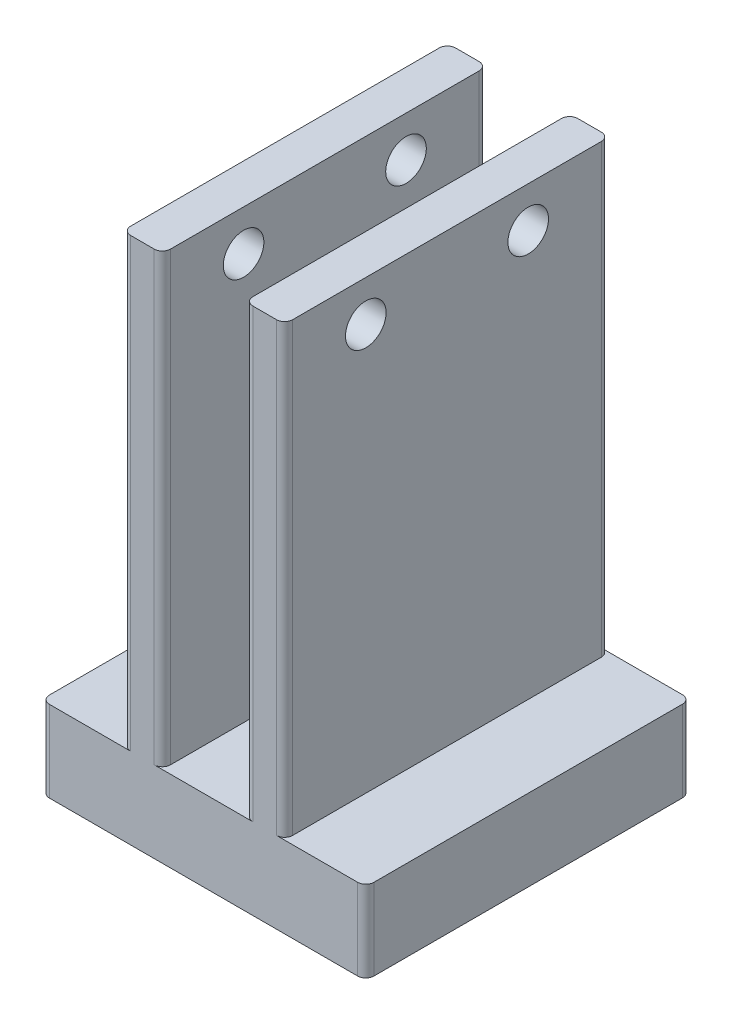
ISO-10303-21;
HEADER;
FILE_DESCRIPTION(('STEP AP214'),'2;1');
FILE_NAME('part.step','',(''),(''),'','','');
FILE_SCHEMA(('AUTOMOTIVE_DESIGN { 1 0 10303 214 1 1 1 1 }'));
ENDSEC;
DATA;
#1=APPLICATION_CONTEXT('core data for automotive mechanical design processes');
#2=APPLICATION_PROTOCOL_DEFINITION('international standard','automotive_design',2000,#1);
#3=PRODUCT_CONTEXT('',#1,'mechanical');
#4=PRODUCT('Part','Part','',(#3));
#5=PRODUCT_RELATED_PRODUCT_CATEGORY('part','',(#4));
#6=PRODUCT_DEFINITION_FORMATION('','',#4);
#7=PRODUCT_DEFINITION_CONTEXT('part definition',#1,'design');
#8=PRODUCT_DEFINITION('design','',#6,#7);
#9=PRODUCT_DEFINITION_SHAPE('','',#8);
#10=(LENGTH_UNIT() NAMED_UNIT(*) SI_UNIT(.MILLI.,.METRE.));
#11=(NAMED_UNIT(*) PLANE_ANGLE_UNIT() SI_UNIT($,.RADIAN.));
#12=(NAMED_UNIT(*) SI_UNIT($,.STERADIAN.) SOLID_ANGLE_UNIT());
#13=UNCERTAINTY_MEASURE_WITH_UNIT(LENGTH_MEASURE(1.E-05),#10,'distance_accuracy_value','');
#14=(GEOMETRIC_REPRESENTATION_CONTEXT(3) GLOBAL_UNCERTAINTY_ASSIGNED_CONTEXT((#13)) GLOBAL_UNIT_ASSIGNED_CONTEXT((#10,
#11,#12)) REPRESENTATION_CONTEXT('',''));
#15=CARTESIAN_POINT('',(0.,0.,0.));
#16=DIRECTION('',(0.,0.,1.));
#17=DIRECTION('',(1.,0.,0.));
#18=AXIS2_PLACEMENT_3D('',#15,#16,#17);
#19=CARTESIAN_POINT('',(7.44999999999999,-10.,20.));
#20=DIRECTION('',(-1.,0.,0.));
#21=DIRECTION('',(0.,0.,1.));
#22=AXIS2_PLACEMENT_3D('',#19,#20,#21);
#23=PLANE('',#22);
#24=CARTESIAN_POINT('',(7.44999999999999,50.,10.));
#25=DIRECTION('',(-1.,0.,0.));
#26=DIRECTION('',(0.,0.,1.));
#27=AXIS2_PLACEMENT_3D('',#24,#25,#26);
#28=CIRCLE('',#27,2.5);
#29=CARTESIAN_POINT('',(7.44999999999999,50.,12.5));
#30=VERTEX_POINT('',#29);
#31=EDGE_CURVE('E270',#30,#30,#28,.F.);
#32=ORIENTED_EDGE('',*,*,#31,.F.);
#33=EDGE_LOOP('',(#32));
#34=FACE_BOUND('',#33,.T.);
#35=CARTESIAN_POINT('',(7.44999999999999,50.,-10.));
#36=DIRECTION('',(-1.,0.,0.));
#37=DIRECTION('',(0.,0.,1.));
#38=AXIS2_PLACEMENT_3D('',#35,#36,#37);
#39=CIRCLE('',#38,2.5);
#40=CARTESIAN_POINT('',(7.44999999999999,50.,-7.5));
#41=VERTEX_POINT('',#40);
#42=EDGE_CURVE('E275',#41,#41,#39,.F.);
#43=ORIENTED_EDGE('',*,*,#42,.F.);
#44=EDGE_LOOP('',(#43));
#45=FACE_BOUND('',#44,.T.);
#46=DIRECTION('',(0.,0.,-1.));
#47=VECTOR('',#46,1.);
#48=CARTESIAN_POINT('',(7.45,55.,-20.));
#49=LINE('',#48,#47);
#50=CARTESIAN_POINT('',(7.45,55.,19.));
#51=VERTEX_POINT('',#50);
#52=CARTESIAN_POINT('',(7.45,55.,-19.));
#53=VERTEX_POINT('',#52);
#54=EDGE_CURVE('E306',#51,#53,#49,.T.);
#55=ORIENTED_EDGE('',*,*,#54,.F.);
#56=DIRECTION('',(0.,1.,0.));
#57=VECTOR('',#56,1.);
#58=CARTESIAN_POINT('',(7.44999999999999,-10.,19.));
#59=LINE('',#58,#57);
#60=CARTESIAN_POINT('',(7.44999999999999,0.,19.));
#61=VERTEX_POINT('',#60);
#62=EDGE_CURVE('E458',#51,#61,#59,.F.);
#63=ORIENTED_EDGE('',*,*,#62,.T.);
#64=DIRECTION('',(0.,0.,1.));
#65=VECTOR('',#64,1.);
#66=CARTESIAN_POINT('',(7.44999999999999,0.,20.));
#67=LINE('',#66,#65);
#68=CARTESIAN_POINT('',(7.44999999999999,0.,-19.));
#69=VERTEX_POINT('',#68);
#70=EDGE_CURVE('E238',#69,#61,#67,.T.);
#71=ORIENTED_EDGE('',*,*,#70,.F.);
#72=DIRECTION('',(0.,1.,0.));
#73=VECTOR('',#72,1.);
#74=CARTESIAN_POINT('',(7.45,-10.,-19.));
#75=LINE('',#74,#73);
#76=EDGE_CURVE('E455',#69,#53,#75,.T.);
#77=ORIENTED_EDGE('',*,*,#76,.T.);
#78=EDGE_LOOP('',(#55,#63,#71,#77));
#79=FACE_BOUND('',#78,.T.);
#80=ADVANCED_FACE('F43',(#34,#45,#79),#23,.F.);
#81=CARTESIAN_POINT('',(-12.5,55.,-20.));
#82=DIRECTION('',(1.,0.,0.));
#83=DIRECTION('',(0.,0.,-1.));
#84=AXIS2_PLACEMENT_3D('',#81,#82,#83);
#85=PLANE('',#84);
#86=CARTESIAN_POINT('',(-12.5,50.,10.));
#87=DIRECTION('',(-1.,0.,0.));
#88=DIRECTION('',(0.,0.,1.));
#89=AXIS2_PLACEMENT_3D('',#86,#87,#88);
#90=CIRCLE('',#89,2.5);
#91=CARTESIAN_POINT('',(-12.5,50.,12.5));
#92=VERTEX_POINT('',#91);
#93=EDGE_CURVE('E276',#92,#92,#90,.T.);
#94=ORIENTED_EDGE('',*,*,#93,.F.);
#95=EDGE_LOOP('',(#94));
#96=FACE_BOUND('',#95,.T.);
#97=CARTESIAN_POINT('',(-12.5,50.,-10.));
#98=DIRECTION('',(-1.,0.,0.));
#99=DIRECTION('',(0.,0.,1.));
#100=AXIS2_PLACEMENT_3D('',#97,#98,#99);
#101=CIRCLE('',#100,2.5);
#102=CARTESIAN_POINT('',(-12.5,50.,-7.5));
#103=VERTEX_POINT('',#102);
#104=EDGE_CURVE('E271',#103,#103,#101,.T.);
#105=ORIENTED_EDGE('',*,*,#104,.F.);
#106=EDGE_LOOP('',(#105));
#107=FACE_BOUND('',#106,.T.);
#108=DIRECTION('',(0.,0.,-1.));
#109=VECTOR('',#108,1.);
#110=CARTESIAN_POINT('',(-12.5,0.,-20.));
#111=LINE('',#110,#109);
#112=CARTESIAN_POINT('',(-12.5,0.,19.));
#113=VERTEX_POINT('',#112);
#114=CARTESIAN_POINT('',(-12.5,0.,-19.));
#115=VERTEX_POINT('',#114);
#116=EDGE_CURVE('E252',#113,#115,#111,.T.);
#117=ORIENTED_EDGE('',*,*,#116,.F.);
#118=DIRECTION('',(0.,-1.,0.));
#119=VECTOR('',#118,1.);
#120=CARTESIAN_POINT('',(-12.5,55.,19.));
#121=LINE('',#120,#119);
#122=CARTESIAN_POINT('',(-12.5,55.,19.));
#123=VERTEX_POINT('',#122);
#124=EDGE_CURVE('E465',#113,#123,#121,.F.);
#125=ORIENTED_EDGE('',*,*,#124,.T.);
#126=DIRECTION('',(0.,0.,1.));
#127=VECTOR('',#126,1.);
#128=CARTESIAN_POINT('',(-12.5,55.,-20.));
#129=LINE('',#128,#127);
#130=CARTESIAN_POINT('',(-12.5,55.,-19.));
#131=VERTEX_POINT('',#130);
#132=EDGE_CURVE('E327',#131,#123,#129,.T.);
#133=ORIENTED_EDGE('',*,*,#132,.F.);
#134=DIRECTION('',(0.,-1.,0.));
#135=VECTOR('',#134,1.);
#136=CARTESIAN_POINT('',(-12.5,55.,-19.));
#137=LINE('',#136,#135);
#138=EDGE_CURVE('E461',#131,#115,#137,.T.);
#139=ORIENTED_EDGE('',*,*,#138,.T.);
#140=EDGE_LOOP('',(#117,#125,#133,#139));
#141=FACE_BOUND('',#140,.T.);
#142=ADVANCED_FACE('F565',(#96,#107,#141),#85,.F.);
#143=CARTESIAN_POINT('',(0.,0.,0.));
#144=DIRECTION('',(0.,-1.,0.));
#145=DIRECTION('',(0.,0.,-1.));
#146=AXIS2_PLACEMENT_3D('',#143,#144,#145);
#147=PLANE('',#146);
#148=DIRECTION('',(0.,0.,1.));
#149=VECTOR('',#148,1.);
#150=CARTESIAN_POINT('',(2.55,0.,-20.));
#151=LINE('',#150,#149);
#152=CARTESIAN_POINT('',(2.55,0.,-19.));
#153=VERTEX_POINT('',#152);
#154=CARTESIAN_POINT('',(2.55,0.,19.));
#155=VERTEX_POINT('',#154);
#156=EDGE_CURVE('E297',#153,#155,#151,.T.);
#157=ORIENTED_EDGE('',*,*,#156,.F.);
#158=CARTESIAN_POINT('',(3.55,0.,-19.));
#159=DIRECTION('',(0.,-1.,0.));
#160=DIRECTION('',(0.,0.,-1.));
#161=AXIS2_PLACEMENT_3D('',#158,#159,#160);
#162=CIRCLE('',#161,1.);
#163=CARTESIAN_POINT('',(3.55,0.,-20.));
#164=VERTEX_POINT('',#163);
#165=EDGE_CURVE('E471',#153,#164,#162,.T.);
#166=ORIENTED_EDGE('',*,*,#165,.T.);
#167=DIRECTION('',(1.,0.,0.));
#168=VECTOR('',#167,1.);
#169=CARTESIAN_POINT('',(-12.5,0.,-20.));
#170=LINE('',#169,#168);
#171=CARTESIAN_POINT('',(-8.60000000000001,0.,-20.));
#172=VERTEX_POINT('',#171);
#173=EDGE_CURVE('E301',#172,#164,#170,.T.);
#174=ORIENTED_EDGE('',*,*,#173,.F.);
#175=CARTESIAN_POINT('',(-8.60000000000001,0.,-19.));
#176=DIRECTION('',(0.,-1.,0.));
#177=DIRECTION('',(0.,0.,-1.));
#178=AXIS2_PLACEMENT_3D('',#175,#176,#177);
#179=CIRCLE('',#178,1.);
#180=CARTESIAN_POINT('',(-7.60000000000001,0.,-19.));
#181=VERTEX_POINT('',#180);
#182=EDGE_CURVE('E468',#172,#181,#179,.T.);
#183=ORIENTED_EDGE('',*,*,#182,.T.);
#184=DIRECTION('',(0.,0.,-1.));
#185=VECTOR('',#184,1.);
#186=CARTESIAN_POINT('',(-7.60000000000001,0.,-20.));
#187=LINE('',#186,#185);
#188=CARTESIAN_POINT('',(-7.6,0.,19.));
#189=VERTEX_POINT('',#188);
#190=EDGE_CURVE('E322',#189,#181,#187,.T.);
#191=ORIENTED_EDGE('',*,*,#190,.F.);
#192=CARTESIAN_POINT('',(-8.6,0.,19.));
#193=DIRECTION('',(0.,-1.,0.));
#194=DIRECTION('',(0.,0.,-1.));
#195=AXIS2_PLACEMENT_3D('',#192,#193,#194);
#196=CIRCLE('',#195,1.);
#197=CARTESIAN_POINT('',(-8.6,0.,20.));
#198=VERTEX_POINT('',#197);
#199=EDGE_CURVE('E478',#189,#198,#196,.T.);
#200=ORIENTED_EDGE('',*,*,#199,.T.);
#201=DIRECTION('',(-1.,0.,0.));
#202=VECTOR('',#201,1.);
#203=CARTESIAN_POINT('',(-12.5,0.,20.));
#204=LINE('',#203,#202);
#205=CARTESIAN_POINT('',(3.55,0.,20.));
#206=VERTEX_POINT('',#205);
#207=EDGE_CURVE('E319',#206,#198,#204,.T.);
#208=ORIENTED_EDGE('',*,*,#207,.F.);
#209=CARTESIAN_POINT('',(3.55,0.,19.));
#210=DIRECTION('',(0.,-1.,0.));
#211=DIRECTION('',(0.,0.,-1.));
#212=AXIS2_PLACEMENT_3D('',#209,#210,#211);
#213=CIRCLE('',#212,1.);
#214=EDGE_CURVE('E475',#206,#155,#213,.T.);
#215=ORIENTED_EDGE('',*,*,#214,.T.);
#216=EDGE_LOOP('',(#157,#166,#174,#183,#191,#200,#208,#215));
#217=FACE_BOUND('',#216,.T.);
#218=ADVANCED_FACE('F518',(#217),#147,.F.);
#219=CARTESIAN_POINT('',(-12.5,55.,20.));
#220=DIRECTION('',(0.,0.,-1.));
#221=DIRECTION('',(-1.,0.,0.));
#222=AXIS2_PLACEMENT_3D('',#219,#220,#221);
#223=PLANE('',#222);
#224=DIRECTION('',(1.,0.,0.));
#225=VECTOR('',#224,1.);
#226=CARTESIAN_POINT('',(-22.5,0.,20.));
#227=LINE('',#226,#225);
#228=CARTESIAN_POINT('',(-21.5,0.,20.));
#229=VERTEX_POINT('',#228);
#230=CARTESIAN_POINT('',(-11.5,0.,20.));
#231=VERTEX_POINT('',#230);
#232=EDGE_CURVE('E267',#229,#231,#227,.T.);
#233=ORIENTED_EDGE('',*,*,#232,.F.);
#234=DIRECTION('',(0.,1.,0.));
#235=VECTOR('',#234,1.);
#236=CARTESIAN_POINT('',(-21.5,55.,20.));
#237=LINE('',#236,#235);
#238=CARTESIAN_POINT('',(-21.5,-10.,20.));
#239=VERTEX_POINT('',#238);
#240=EDGE_CURVE('E416',#229,#239,#237,.F.);
#241=ORIENTED_EDGE('',*,*,#240,.T.);
#242=DIRECTION('',(-1.,0.,0.));
#243=VECTOR('',#242,1.);
#244=CARTESIAN_POINT('',(-12.5,-10.,20.));
#245=LINE('',#244,#243);
#246=CARTESIAN_POINT('',(16.45,-10.,20.));
#247=VERTEX_POINT('',#246);
#248=EDGE_CURVE('E318',#247,#239,#245,.T.);
#249=ORIENTED_EDGE('',*,*,#248,.F.);
#250=DIRECTION('',(0.,-1.,0.));
#251=VECTOR('',#250,1.);
#252=CARTESIAN_POINT('',(16.45,55.,20.));
#253=LINE('',#252,#251);
#254=CARTESIAN_POINT('',(16.45,0.,20.));
#255=VERTEX_POINT('',#254);
#256=EDGE_CURVE('E211',#247,#255,#253,.F.);
#257=ORIENTED_EDGE('',*,*,#256,.T.);
#258=DIRECTION('',(-1.,0.,0.));
#259=VECTOR('',#258,1.);
#260=CARTESIAN_POINT('',(17.45,0.,20.));
#261=LINE('',#260,#259);
#262=CARTESIAN_POINT('',(6.44999999999999,0.,20.));
#263=VERTEX_POINT('',#262);
#264=EDGE_CURVE('E242',#255,#263,#261,.T.);
#265=ORIENTED_EDGE('',*,*,#264,.T.);
#266=DIRECTION('',(0.,1.,0.));
#267=VECTOR('',#266,1.);
#268=CARTESIAN_POINT('',(6.44999999999999,55.,20.));
#269=LINE('',#268,#267);
#270=CARTESIAN_POINT('',(6.44999999999999,55.,20.));
#271=VERTEX_POINT('',#270);
#272=EDGE_CURVE('E403',#263,#271,#269,.T.);
#273=ORIENTED_EDGE('',*,*,#272,.T.);
#274=DIRECTION('',(1.,0.,0.));
#275=VECTOR('',#274,1.);
#276=CARTESIAN_POINT('',(2.55,55.,20.));
#277=LINE('',#276,#275);
#278=CARTESIAN_POINT('',(3.55,55.,20.));
#279=VERTEX_POINT('',#278);
#280=EDGE_CURVE('E309',#279,#271,#277,.T.);
#281=ORIENTED_EDGE('',*,*,#280,.F.);
#282=DIRECTION('',(0.,-1.,0.));
#283=VECTOR('',#282,1.);
#284=CARTESIAN_POINT('',(3.55,55.,20.));
#285=LINE('',#284,#283);
#286=EDGE_CURVE('E410',#279,#206,#285,.T.);
#287=ORIENTED_EDGE('',*,*,#286,.T.);
#288=ORIENTED_EDGE('',*,*,#207,.T.);
#289=DIRECTION('',(0.,-1.,0.));
#290=VECTOR('',#289,1.);
#291=CARTESIAN_POINT('',(-8.6,55.,20.));
#292=LINE('',#291,#290);
#293=CARTESIAN_POINT('',(-8.6,55.,20.));
#294=VERTEX_POINT('',#293);
#295=EDGE_CURVE('E407',#198,#294,#292,.F.);
#296=ORIENTED_EDGE('',*,*,#295,.T.);
#297=DIRECTION('',(1.,0.,0.));
#298=VECTOR('',#297,1.);
#299=CARTESIAN_POINT('',(-12.5,55.,20.));
#300=LINE('',#299,#298);
#301=CARTESIAN_POINT('',(-11.5,55.,20.));
#302=VERTEX_POINT('',#301);
#303=EDGE_CURVE('E331',#302,#294,#300,.T.);
#304=ORIENTED_EDGE('',*,*,#303,.F.);
#305=DIRECTION('',(0.,-1.,0.));
#306=VECTOR('',#305,1.);
#307=CARTESIAN_POINT('',(-11.5,55.,20.));
#308=LINE('',#307,#306);
#309=EDGE_CURVE('E399',#302,#231,#308,.T.);
#310=ORIENTED_EDGE('',*,*,#309,.T.);
#311=EDGE_LOOP('',(#233,#241,#249,#257,#265,#273,#281,#287,#288,#296,#304,#310));
#312=FACE_BOUND('',#311,.T.);
#313=ADVANCED_FACE('F536',(#312),#223,.F.);
#314=CARTESIAN_POINT('',(-7.60000000000001,55.,-20.));
#315=DIRECTION('',(-1.,0.,0.));
#316=DIRECTION('',(0.,0.,1.));
#317=AXIS2_PLACEMENT_3D('',#314,#315,#316);
#318=PLANE('',#317);
#319=CARTESIAN_POINT('',(-7.60000000000001,50.,-10.));
#320=DIRECTION('',(-1.,0.,0.));
#321=DIRECTION('',(0.,0.,1.));
#322=AXIS2_PLACEMENT_3D('',#319,#320,#321);
#323=CIRCLE('',#322,2.5);
#324=CARTESIAN_POINT('',(-7.6,50.,-7.5));
#325=VERTEX_POINT('',#324);
#326=EDGE_CURVE('E292',#325,#325,#323,.T.);
#327=ORIENTED_EDGE('',*,*,#326,.T.);
#328=EDGE_LOOP('',(#327));
#329=FACE_BOUND('',#328,.T.);
#330=CARTESIAN_POINT('',(-7.6,50.,10.));
#331=DIRECTION('',(-1.,0.,0.));
#332=DIRECTION('',(0.,0.,1.));
#333=AXIS2_PLACEMENT_3D('',#330,#331,#332);
#334=CIRCLE('',#333,2.5);
#335=CARTESIAN_POINT('',(-7.6,50.,12.5));
#336=VERTEX_POINT('',#335);
#337=EDGE_CURVE('E287',#336,#336,#334,.T.);
#338=ORIENTED_EDGE('',*,*,#337,.T.);
#339=EDGE_LOOP('',(#338));
#340=FACE_BOUND('',#339,.T.);
#341=ORIENTED_EDGE('',*,*,#190,.T.);
#342=DIRECTION('',(0.,-1.,0.));
#343=VECTOR('',#342,1.);
#344=CARTESIAN_POINT('',(-7.60000000000001,55.,-19.));
#345=LINE('',#344,#343);
#346=CARTESIAN_POINT('',(-7.60000000000001,55.,-19.));
#347=VERTEX_POINT('',#346);
#348=EDGE_CURVE('E423',#181,#347,#345,.F.);
#349=ORIENTED_EDGE('',*,*,#348,.T.);
#350=DIRECTION('',(0.,0.,-1.));
#351=VECTOR('',#350,1.);
#352=CARTESIAN_POINT('',(-7.60000000000001,55.,-20.));
#353=LINE('',#352,#351);
#354=CARTESIAN_POINT('',(-7.6,55.,19.));
#355=VERTEX_POINT('',#354);
#356=EDGE_CURVE('E335',#355,#347,#353,.T.);
#357=ORIENTED_EDGE('',*,*,#356,.F.);
#358=DIRECTION('',(0.,-1.,0.));
#359=VECTOR('',#358,1.);
#360=CARTESIAN_POINT('',(-7.6,55.,19.));
#361=LINE('',#360,#359);
#362=EDGE_CURVE('E419',#355,#189,#361,.T.);
#363=ORIENTED_EDGE('',*,*,#362,.T.);
#364=EDGE_LOOP('',(#341,#349,#357,#363));
#365=FACE_BOUND('',#364,.T.);
#366=ADVANCED_FACE('F581',(#329,#340,#365),#318,.F.);
#367=CARTESIAN_POINT('',(-12.5,55.,-20.));
#368=DIRECTION('',(0.,0.,1.));
#369=DIRECTION('',(1.,0.,0.));
#370=AXIS2_PLACEMENT_3D('',#367,#368,#369);
#371=PLANE('',#370);
#372=DIRECTION('',(-1.,0.,0.));
#373=VECTOR('',#372,1.);
#374=CARTESIAN_POINT('',(17.45,0.,-20.));
#375=LINE('',#374,#373);
#376=CARTESIAN_POINT('',(16.45,0.,-20.));
#377=VERTEX_POINT('',#376);
#378=CARTESIAN_POINT('',(6.45,0.,-20.));
#379=VERTEX_POINT('',#378);
#380=EDGE_CURVE('E249',#377,#379,#375,.T.);
#381=ORIENTED_EDGE('',*,*,#380,.F.);
#382=DIRECTION('',(0.,1.,0.));
#383=VECTOR('',#382,1.);
#384=CARTESIAN_POINT('',(16.45,55.,-20.));
#385=LINE('',#384,#383);
#386=CARTESIAN_POINT('',(16.45,-10.,-20.));
#387=VERTEX_POINT('',#386);
#388=EDGE_CURVE('E218',#377,#387,#385,.F.);
#389=ORIENTED_EDGE('',*,*,#388,.T.);
#390=DIRECTION('',(1.,0.,0.));
#391=VECTOR('',#390,1.);
#392=CARTESIAN_POINT('',(-12.5,-10.,-20.));
#393=LINE('',#392,#391);
#394=CARTESIAN_POINT('',(-21.5,-10.,-20.));
#395=VERTEX_POINT('',#394);
#396=EDGE_CURVE('E315',#395,#387,#393,.T.);
#397=ORIENTED_EDGE('',*,*,#396,.F.);
#398=DIRECTION('',(0.,-1.,0.));
#399=VECTOR('',#398,1.);
#400=CARTESIAN_POINT('',(-21.5,55.,-20.));
#401=LINE('',#400,#399);
#402=CARTESIAN_POINT('',(-21.5,0.,-20.));
#403=VERTEX_POINT('',#402);
#404=EDGE_CURVE('E373',#395,#403,#401,.F.);
#405=ORIENTED_EDGE('',*,*,#404,.T.);
#406=DIRECTION('',(1.,0.,0.));
#407=VECTOR('',#406,1.);
#408=CARTESIAN_POINT('',(-22.5,0.,-20.));
#409=LINE('',#408,#407);
#410=CARTESIAN_POINT('',(-11.5,0.,-20.));
#411=VERTEX_POINT('',#410);
#412=EDGE_CURVE('E261',#403,#411,#409,.T.);
#413=ORIENTED_EDGE('',*,*,#412,.T.);
#414=DIRECTION('',(0.,-1.,0.));
#415=VECTOR('',#414,1.);
#416=CARTESIAN_POINT('',(-11.5,55.,-20.));
#417=LINE('',#416,#415);
#418=CARTESIAN_POINT('',(-11.5,55.,-20.));
#419=VERTEX_POINT('',#418);
#420=EDGE_CURVE('E363',#411,#419,#417,.F.);
#421=ORIENTED_EDGE('',*,*,#420,.T.);
#422=DIRECTION('',(-1.,0.,0.));
#423=VECTOR('',#422,1.);
#424=CARTESIAN_POINT('',(-12.5,55.,-20.));
#425=LINE('',#424,#423);
#426=CARTESIAN_POINT('',(-8.60000000000001,55.,-20.));
#427=VERTEX_POINT('',#426);
#428=EDGE_CURVE('E231',#427,#419,#425,.T.);
#429=ORIENTED_EDGE('',*,*,#428,.F.);
#430=DIRECTION('',(0.,-1.,0.));
#431=VECTOR('',#430,1.);
#432=CARTESIAN_POINT('',(-8.60000000000001,55.,-20.));
#433=LINE('',#432,#431);
#434=EDGE_CURVE('E369',#427,#172,#433,.T.);
#435=ORIENTED_EDGE('',*,*,#434,.T.);
#436=ORIENTED_EDGE('',*,*,#173,.T.);
#437=DIRECTION('',(0.,-1.,0.));
#438=VECTOR('',#437,1.);
#439=CARTESIAN_POINT('',(3.55,55.,-20.));
#440=LINE('',#439,#438);
#441=CARTESIAN_POINT('',(3.55,55.,-20.));
#442=VERTEX_POINT('',#441);
#443=EDGE_CURVE('E366',#164,#442,#440,.F.);
#444=ORIENTED_EDGE('',*,*,#443,.T.);
#445=DIRECTION('',(-1.,0.,0.));
#446=VECTOR('',#445,1.);
#447=CARTESIAN_POINT('',(2.55,55.,-20.));
#448=LINE('',#447,#446);
#449=CARTESIAN_POINT('',(6.45,55.,-20.));
#450=VERTEX_POINT('',#449);
#451=EDGE_CURVE('E296',#450,#442,#448,.T.);
#452=ORIENTED_EDGE('',*,*,#451,.F.);
#453=DIRECTION('',(0.,1.,0.));
#454=VECTOR('',#453,1.);
#455=CARTESIAN_POINT('',(6.45,55.,-20.));
#456=LINE('',#455,#454);
#457=EDGE_CURVE('E359',#450,#379,#456,.F.);
#458=ORIENTED_EDGE('',*,*,#457,.T.);
#459=EDGE_LOOP('',(#381,#389,#397,#405,#413,#421,#429,#435,#436,#444,#452,#458));
#460=FACE_BOUND('',#459,.T.);
#461=ADVANCED_FACE('F503',(#460),#371,.F.);
#462=CARTESIAN_POINT('',(0.,55.,0.));
#463=DIRECTION('',(0.,1.,0.));
#464=DIRECTION('',(0.,0.,1.));
#465=AXIS2_PLACEMENT_3D('',#462,#463,#464);
#466=PLANE('',#465);
#467=ORIENTED_EDGE('',*,*,#356,.T.);
#468=CARTESIAN_POINT('',(-8.60000000000001,55.,-19.));
#469=DIRECTION('',(0.,1.,0.));
#470=DIRECTION('',(0.,0.,1.));
#471=AXIS2_PLACEMENT_3D('',#468,#469,#470);
#472=CIRCLE('',#471,1.);
#473=EDGE_CURVE('E435',#347,#427,#472,.T.);
#474=ORIENTED_EDGE('',*,*,#473,.T.);
#475=ORIENTED_EDGE('',*,*,#428,.T.);
#476=CARTESIAN_POINT('',(-11.5,55.,-19.));
#477=DIRECTION('',(0.,1.,0.));
#478=DIRECTION('',(0.,0.,1.));
#479=AXIS2_PLACEMENT_3D('',#476,#477,#478);
#480=CIRCLE('',#479,1.);
#481=EDGE_CURVE('E426',#419,#131,#480,.T.);
#482=ORIENTED_EDGE('',*,*,#481,.T.);
#483=ORIENTED_EDGE('',*,*,#132,.T.);
#484=CARTESIAN_POINT('',(-11.5,55.,19.));
#485=DIRECTION('',(0.,1.,0.));
#486=DIRECTION('',(0.,0.,1.));
#487=AXIS2_PLACEMENT_3D('',#484,#485,#486);
#488=CIRCLE('',#487,1.);
#489=EDGE_CURVE('E429',#123,#302,#488,.T.);
#490=ORIENTED_EDGE('',*,*,#489,.T.);
#491=ORIENTED_EDGE('',*,*,#303,.T.);
#492=CARTESIAN_POINT('',(-8.6,55.,19.));
#493=DIRECTION('',(0.,1.,0.));
#494=DIRECTION('',(0.,0.,1.));
#495=AXIS2_PLACEMENT_3D('',#492,#493,#494);
#496=CIRCLE('',#495,1.);
#497=EDGE_CURVE('E432',#294,#355,#496,.T.);
#498=ORIENTED_EDGE('',*,*,#497,.T.);
#499=EDGE_LOOP('',(#467,#474,#475,#482,#483,#490,#491,#498));
#500=FACE_BOUND('',#499,.T.);
#501=ADVANCED_FACE('F506',(#500),#466,.T.);
#502=CARTESIAN_POINT('',(0.,-10.,0.));
#503=DIRECTION('',(0.,-1.,0.));
#504=DIRECTION('',(0.,0.,-1.));
#505=AXIS2_PLACEMENT_3D('',#502,#503,#504);
#506=PLANE('',#505);
#507=ORIENTED_EDGE('',*,*,#396,.T.);
#508=CARTESIAN_POINT('',(16.45,-10.,-19.));
#509=DIRECTION('',(0.,-1.,0.));
#510=DIRECTION('',(0.,0.,-1.));
#511=AXIS2_PLACEMENT_3D('',#508,#509,#510);
#512=CIRCLE('',#511,1.);
#513=CARTESIAN_POINT('',(17.45,-10.,-19.));
#514=VERTEX_POINT('',#513);
#515=EDGE_CURVE('E236',#387,#514,#512,.T.);
#516=ORIENTED_EDGE('',*,*,#515,.T.);
#517=DIRECTION('',(0.,0.,-1.));
#518=VECTOR('',#517,1.);
#519=CARTESIAN_POINT('',(17.45,-10.,20.));
#520=LINE('',#519,#518);
#521=CARTESIAN_POINT('',(17.45,-10.,19.));
#522=VERTEX_POINT('',#521);
#523=EDGE_CURVE('E225',#522,#514,#520,.T.);
#524=ORIENTED_EDGE('',*,*,#523,.F.);
#525=CARTESIAN_POINT('',(16.45,-10.,19.));
#526=DIRECTION('',(0.,-1.,0.));
#527=DIRECTION('',(0.,0.,-1.));
#528=AXIS2_PLACEMENT_3D('',#525,#526,#527);
#529=CIRCLE('',#528,1.);
#530=EDGE_CURVE('E206',#522,#247,#529,.T.);
#531=ORIENTED_EDGE('',*,*,#530,.T.);
#532=ORIENTED_EDGE('',*,*,#248,.T.);
#533=CARTESIAN_POINT('',(-21.5,-10.,19.));
#534=DIRECTION('',(0.,-1.,0.));
#535=DIRECTION('',(0.,0.,-1.));
#536=AXIS2_PLACEMENT_3D('',#533,#534,#535);
#537=CIRCLE('',#536,1.);
#538=CARTESIAN_POINT('',(-22.5,-10.,19.));
#539=VERTEX_POINT('',#538);
#540=EDGE_CURVE('E217',#239,#539,#537,.T.);
#541=ORIENTED_EDGE('',*,*,#540,.T.);
#542=DIRECTION('',(0.,0.,1.));
#543=VECTOR('',#542,1.);
#544=CARTESIAN_POINT('',(-22.5,-10.,-20.));
#545=LINE('',#544,#543);
#546=CARTESIAN_POINT('',(-22.5,-10.,-19.));
#547=VERTEX_POINT('',#546);
#548=EDGE_CURVE('E253',#547,#539,#545,.T.);
#549=ORIENTED_EDGE('',*,*,#548,.F.);
#550=CARTESIAN_POINT('',(-21.5,-10.,-19.));
#551=DIRECTION('',(0.,-1.,0.));
#552=DIRECTION('',(0.,0.,-1.));
#553=AXIS2_PLACEMENT_3D('',#550,#551,#552);
#554=CIRCLE('',#553,1.);
#555=EDGE_CURVE('E380',#547,#395,#554,.T.);
#556=ORIENTED_EDGE('',*,*,#555,.T.);
#557=EDGE_LOOP('',(#507,#516,#524,#531,#532,#541,#549,#556));
#558=FACE_BOUND('',#557,.T.);
#559=ADVANCED_FACE('F234',(#558),#506,.T.);
#560=CARTESIAN_POINT('',(2.55,55.,-20.));
#561=DIRECTION('',(1.,0.,0.));
#562=DIRECTION('',(0.,0.,-1.));
#563=AXIS2_PLACEMENT_3D('',#560,#561,#562);
#564=PLANE('',#563);
#565=CARTESIAN_POINT('',(2.55,50.,-10.));
#566=DIRECTION('',(1.,0.,0.));
#567=DIRECTION('',(0.,0.,-1.));
#568=AXIS2_PLACEMENT_3D('',#565,#566,#567);
#569=CIRCLE('',#568,2.5);
#570=CARTESIAN_POINT('',(2.55,50.,-12.5));
#571=VERTEX_POINT('',#570);
#572=EDGE_CURVE('E291',#571,#571,#569,.T.);
#573=ORIENTED_EDGE('',*,*,#572,.T.);
#574=EDGE_LOOP('',(#573));
#575=FACE_BOUND('',#574,.T.);
#576=CARTESIAN_POINT('',(2.55,50.,10.));
#577=DIRECTION('',(1.,0.,0.));
#578=DIRECTION('',(0.,0.,-1.));
#579=AXIS2_PLACEMENT_3D('',#576,#577,#578);
#580=CIRCLE('',#579,2.5);
#581=CARTESIAN_POINT('',(2.55,50.,7.5));
#582=VERTEX_POINT('',#581);
#583=EDGE_CURVE('E280',#582,#582,#580,.T.);
#584=ORIENTED_EDGE('',*,*,#583,.T.);
#585=EDGE_LOOP('',(#584));
#586=FACE_BOUND('',#585,.T.);
#587=DIRECTION('',(0.,0.,1.));
#588=VECTOR('',#587,1.);
#589=CARTESIAN_POINT('',(2.55,55.,-20.));
#590=LINE('',#589,#588);
#591=CARTESIAN_POINT('',(2.55,55.,-19.));
#592=VERTEX_POINT('',#591);
#593=CARTESIAN_POINT('',(2.55,55.,19.));
#594=VERTEX_POINT('',#593);
#595=EDGE_CURVE('E302',#592,#594,#590,.T.);
#596=ORIENTED_EDGE('',*,*,#595,.F.);
#597=DIRECTION('',(0.,-1.,0.));
#598=VECTOR('',#597,1.);
#599=CARTESIAN_POINT('',(2.55,55.,-19.));
#600=LINE('',#599,#598);
#601=EDGE_CURVE('E441',#592,#153,#600,.T.);
#602=ORIENTED_EDGE('',*,*,#601,.T.);
#603=ORIENTED_EDGE('',*,*,#156,.T.);
#604=DIRECTION('',(0.,-1.,0.));
#605=VECTOR('',#604,1.);
#606=CARTESIAN_POINT('',(2.55,55.,19.));
#607=LINE('',#606,#605);
#608=EDGE_CURVE('E438',#155,#594,#607,.F.);
#609=ORIENTED_EDGE('',*,*,#608,.T.);
#610=EDGE_LOOP('',(#596,#602,#603,#609));
#611=FACE_BOUND('',#610,.T.);
#612=ADVANCED_FACE('F527',(#575,#586,#611),#564,.F.);
#613=CARTESIAN_POINT('',(0.,55.,0.));
#614=DIRECTION('',(0.,1.,0.));
#615=DIRECTION('',(0.,0.,1.));
#616=AXIS2_PLACEMENT_3D('',#613,#614,#615);
#617=PLANE('',#616);
#618=ORIENTED_EDGE('',*,*,#451,.T.);
#619=CARTESIAN_POINT('',(3.55,55.,-19.));
#620=DIRECTION('',(0.,1.,0.));
#621=DIRECTION('',(0.,0.,1.));
#622=AXIS2_PLACEMENT_3D('',#619,#620,#621);
#623=CIRCLE('',#622,1.);
#624=EDGE_CURVE('E452',#442,#592,#623,.T.);
#625=ORIENTED_EDGE('',*,*,#624,.T.);
#626=ORIENTED_EDGE('',*,*,#595,.T.);
#627=CARTESIAN_POINT('',(3.55,55.,19.));
#628=DIRECTION('',(0.,1.,0.));
#629=DIRECTION('',(0.,0.,1.));
#630=AXIS2_PLACEMENT_3D('',#627,#628,#629);
#631=CIRCLE('',#630,1.);
#632=EDGE_CURVE('E449',#594,#279,#631,.T.);
#633=ORIENTED_EDGE('',*,*,#632,.T.);
#634=ORIENTED_EDGE('',*,*,#280,.T.);
#635=CARTESIAN_POINT('',(6.44999999999999,55.,19.));
#636=DIRECTION('',(0.,1.,0.));
#637=DIRECTION('',(0.,0.,1.));
#638=AXIS2_PLACEMENT_3D('',#635,#636,#637);
#639=CIRCLE('',#638,1.);
#640=EDGE_CURVE('E67',#271,#51,#639,.T.);
#641=ORIENTED_EDGE('',*,*,#640,.T.);
#642=ORIENTED_EDGE('',*,*,#54,.T.);
#643=CARTESIAN_POINT('',(6.45,55.,-19.));
#644=DIRECTION('',(0.,1.,0.));
#645=DIRECTION('',(0.,0.,1.));
#646=AXIS2_PLACEMENT_3D('',#643,#644,#645);
#647=CIRCLE('',#646,1.);
#648=EDGE_CURVE('E59',#53,#450,#647,.T.);
#649=ORIENTED_EDGE('',*,*,#648,.T.);
#650=EDGE_LOOP('',(#618,#625,#626,#633,#634,#641,#642,#649));
#651=FACE_BOUND('',#650,.T.);
#652=ADVANCED_FACE('F524',(#651),#617,.T.);
#653=CARTESIAN_POINT('',(14.5210678118655,50.,10.));
#654=DIRECTION('',(-1.,0.,0.));
#655=DIRECTION('',(0.,0.,1.));
#656=AXIS2_PLACEMENT_3D('',#653,#654,#655);
#657=CYLINDRICAL_SURFACE('',#656,2.5);
#658=ORIENTED_EDGE('',*,*,#31,.T.);
#659=EDGE_LOOP('',(#658));
#660=FACE_BOUND('',#659,.T.);
#661=ORIENTED_EDGE('',*,*,#583,.F.);
#662=EDGE_LOOP('',(#661));
#663=FACE_BOUND('',#662,.T.);
#664=ADVANCED_FACE('F628',(#660,#663),#657,.F.);
#665=CARTESIAN_POINT('',(14.5210678118655,50.,-10.));
#666=DIRECTION('',(-1.,0.,0.));
#667=DIRECTION('',(0.,0.,1.));
#668=AXIS2_PLACEMENT_3D('',#665,#666,#667);
#669=CYLINDRICAL_SURFACE('',#668,2.5);
#670=ORIENTED_EDGE('',*,*,#42,.T.);
#671=EDGE_LOOP('',(#670));
#672=FACE_BOUND('',#671,.T.);
#673=ORIENTED_EDGE('',*,*,#572,.F.);
#674=EDGE_LOOP('',(#673));
#675=FACE_BOUND('',#674,.T.);
#676=ADVANCED_FACE('F616',(#672,#675),#669,.F.);
#677=ORIENTED_EDGE('',*,*,#93,.T.);
#678=EDGE_LOOP('',(#677));
#679=FACE_BOUND('',#678,.T.);
#680=ORIENTED_EDGE('',*,*,#337,.F.);
#681=EDGE_LOOP('',(#680));
#682=FACE_BOUND('',#681,.T.);
#683=ADVANCED_FACE('F613',(#679,#682),#657,.F.);
#684=ORIENTED_EDGE('',*,*,#104,.T.);
#685=EDGE_LOOP('',(#684));
#686=FACE_BOUND('',#685,.T.);
#687=ORIENTED_EDGE('',*,*,#326,.F.);
#688=EDGE_LOOP('',(#687));
#689=FACE_BOUND('',#688,.T.);
#690=ADVANCED_FACE('F608',(#686,#689),#669,.F.);
#691=CARTESIAN_POINT('',(-22.5,0.,-20.));
#692=DIRECTION('',(0.,-1.,0.));
#693=DIRECTION('',(0.,0.,-1.));
#694=AXIS2_PLACEMENT_3D('',#691,#692,#693);
#695=PLANE('',#694);
#696=ORIENTED_EDGE('',*,*,#412,.F.);
#697=CARTESIAN_POINT('',(-21.5,0.,-19.));
#698=DIRECTION('',(0.,-1.,0.));
#699=DIRECTION('',(0.,0.,-1.));
#700=AXIS2_PLACEMENT_3D('',#697,#698,#699);
#701=CIRCLE('',#700,1.);
#702=CARTESIAN_POINT('',(-22.5,0.,-19.));
#703=VERTEX_POINT('',#702);
#704=EDGE_CURVE('E396',#403,#703,#701,.F.);
#705=ORIENTED_EDGE('',*,*,#704,.T.);
#706=DIRECTION('',(0.,0.,-1.));
#707=VECTOR('',#706,1.);
#708=CARTESIAN_POINT('',(-22.5,0.,-20.));
#709=LINE('',#708,#707);
#710=CARTESIAN_POINT('',(-22.5,0.,19.));
#711=VERTEX_POINT('',#710);
#712=EDGE_CURVE('E257',#711,#703,#709,.T.);
#713=ORIENTED_EDGE('',*,*,#712,.F.);
#714=CARTESIAN_POINT('',(-21.5,0.,19.));
#715=DIRECTION('',(0.,-1.,0.));
#716=DIRECTION('',(0.,0.,-1.));
#717=AXIS2_PLACEMENT_3D('',#714,#715,#716);
#718=CIRCLE('',#717,1.);
#719=EDGE_CURVE('E393',#711,#229,#718,.F.);
#720=ORIENTED_EDGE('',*,*,#719,.T.);
#721=ORIENTED_EDGE('',*,*,#232,.T.);
#722=CARTESIAN_POINT('',(-11.5,0.,19.));
#723=DIRECTION('',(0.,-1.,0.));
#724=DIRECTION('',(0.,0.,-1.));
#725=AXIS2_PLACEMENT_3D('',#722,#723,#724);
#726=CIRCLE('',#725,1.);
#727=EDGE_CURVE('E486',#231,#113,#726,.T.);
#728=ORIENTED_EDGE('',*,*,#727,.T.);
#729=ORIENTED_EDGE('',*,*,#116,.T.);
#730=CARTESIAN_POINT('',(-11.5,0.,-19.));
#731=DIRECTION('',(0.,-1.,0.));
#732=DIRECTION('',(0.,0.,-1.));
#733=AXIS2_PLACEMENT_3D('',#730,#731,#732);
#734=CIRCLE('',#733,1.);
#735=EDGE_CURVE('E52',#115,#411,#734,.T.);
#736=ORIENTED_EDGE('',*,*,#735,.T.);
#737=EDGE_LOOP('',(#696,#705,#713,#720,#721,#728,#729,#736));
#738=FACE_BOUND('',#737,.T.);
#739=ADVANCED_FACE('F493',(#738),#695,.F.);
#740=CARTESIAN_POINT('',(-22.5,0.,0.));
#741=DIRECTION('',(1.,0.,0.));
#742=DIRECTION('',(0.,0.,-1.));
#743=AXIS2_PLACEMENT_3D('',#740,#741,#742);
#744=PLANE('',#743);
#745=ORIENTED_EDGE('',*,*,#712,.T.);
#746=DIRECTION('',(0.,-1.,0.));
#747=VECTOR('',#746,1.);
#748=CARTESIAN_POINT('',(-22.5,0.,-19.));
#749=LINE('',#748,#747);
#750=EDGE_CURVE('E389',#703,#547,#749,.T.);
#751=ORIENTED_EDGE('',*,*,#750,.T.);
#752=ORIENTED_EDGE('',*,*,#548,.T.);
#753=DIRECTION('',(0.,1.,0.));
#754=VECTOR('',#753,1.);
#755=CARTESIAN_POINT('',(-22.5,0.,19.));
#756=LINE('',#755,#754);
#757=EDGE_CURVE('E385',#539,#711,#756,.T.);
#758=ORIENTED_EDGE('',*,*,#757,.T.);
#759=EDGE_LOOP('',(#745,#751,#752,#758));
#760=FACE_BOUND('',#759,.T.);
#761=ADVANCED_FACE('F716',(#760),#744,.F.);
#762=CARTESIAN_POINT('',(17.45,0.,20.));
#763=DIRECTION('',(0.,-1.,0.));
#764=DIRECTION('',(0.,0.,-1.));
#765=AXIS2_PLACEMENT_3D('',#762,#763,#764);
#766=PLANE('',#765);
#767=DIRECTION('',(0.,0.,1.));
#768=VECTOR('',#767,1.);
#769=CARTESIAN_POINT('',(17.45,0.,20.));
#770=LINE('',#769,#768);
#771=CARTESIAN_POINT('',(17.45,0.,-19.));
#772=VERTEX_POINT('',#771);
#773=CARTESIAN_POINT('',(17.45,0.,19.));
#774=VERTEX_POINT('',#773);
#775=EDGE_CURVE('E228',#772,#774,#770,.T.);
#776=ORIENTED_EDGE('',*,*,#775,.F.);
#777=CARTESIAN_POINT('',(16.45,0.,-19.));
#778=DIRECTION('',(0.,-1.,0.));
#779=DIRECTION('',(0.,0.,-1.));
#780=AXIS2_PLACEMENT_3D('',#777,#778,#779);
#781=CIRCLE('',#780,1.);
#782=EDGE_CURVE('E356',#772,#377,#781,.F.);
#783=ORIENTED_EDGE('',*,*,#782,.T.);
#784=ORIENTED_EDGE('',*,*,#380,.T.);
#785=CARTESIAN_POINT('',(6.45,0.,-19.));
#786=DIRECTION('',(0.,-1.,0.));
#787=DIRECTION('',(0.,0.,-1.));
#788=AXIS2_PLACEMENT_3D('',#785,#786,#787);
#789=CIRCLE('',#788,1.);
#790=EDGE_CURVE('E11',#379,#69,#789,.T.);
#791=ORIENTED_EDGE('',*,*,#790,.T.);
#792=ORIENTED_EDGE('',*,*,#70,.T.);
#793=CARTESIAN_POINT('',(6.44999999999999,0.,19.));
#794=DIRECTION('',(0.,-1.,0.));
#795=DIRECTION('',(0.,0.,-1.));
#796=AXIS2_PLACEMENT_3D('',#793,#794,#795);
#797=CIRCLE('',#796,1.);
#798=EDGE_CURVE('E482',#61,#263,#797,.T.);
#799=ORIENTED_EDGE('',*,*,#798,.T.);
#800=ORIENTED_EDGE('',*,*,#264,.F.);
#801=CARTESIAN_POINT('',(16.45,0.,19.));
#802=DIRECTION('',(0.,-1.,0.));
#803=DIRECTION('',(0.,0.,-1.));
#804=AXIS2_PLACEMENT_3D('',#801,#802,#803);
#805=CIRCLE('',#804,1.);
#806=EDGE_CURVE('E353',#255,#774,#805,.F.);
#807=ORIENTED_EDGE('',*,*,#806,.T.);
#808=EDGE_LOOP('',(#776,#783,#784,#791,#792,#799,#800,#807));
#809=FACE_BOUND('',#808,.T.);
#810=ADVANCED_FACE('F546',(#809),#766,.F.);
#811=CARTESIAN_POINT('',(17.45,0.,0.));
#812=DIRECTION('',(-1.,0.,0.));
#813=DIRECTION('',(0.,0.,1.));
#814=AXIS2_PLACEMENT_3D('',#811,#812,#813);
#815=PLANE('',#814);
#816=ORIENTED_EDGE('',*,*,#523,.T.);
#817=DIRECTION('',(0.,1.,0.));
#818=VECTOR('',#817,1.);
#819=CARTESIAN_POINT('',(17.45,0.,-19.));
#820=LINE('',#819,#818);
#821=EDGE_CURVE('E230',#514,#772,#820,.T.);
#822=ORIENTED_EDGE('',*,*,#821,.T.);
#823=ORIENTED_EDGE('',*,*,#775,.T.);
#824=DIRECTION('',(0.,-1.,0.));
#825=VECTOR('',#824,1.);
#826=CARTESIAN_POINT('',(17.45,0.,19.));
#827=LINE('',#826,#825);
#828=EDGE_CURVE('E210',#774,#522,#827,.T.);
#829=ORIENTED_EDGE('',*,*,#828,.T.);
#830=EDGE_LOOP('',(#816,#822,#823,#829));
#831=FACE_BOUND('',#830,.T.);
#832=ADVANCED_FACE('F223',(#831),#815,.F.);
#833=CARTESIAN_POINT('',(16.45,0.,-19.));
#834=DIRECTION('',(0.,1.,0.));
#835=DIRECTION('',(0.,0.,1.));
#836=AXIS2_PLACEMENT_3D('',#833,#834,#835);
#837=CYLINDRICAL_SURFACE('',#836,1.);
#838=ORIENTED_EDGE('',*,*,#515,.F.);
#839=ORIENTED_EDGE('',*,*,#388,.F.);
#840=ORIENTED_EDGE('',*,*,#782,.F.);
#841=ORIENTED_EDGE('',*,*,#821,.F.);
#842=EDGE_LOOP('',(#838,#839,#840,#841));
#843=FACE_BOUND('',#842,.T.);
#844=ADVANCED_FACE('F551',(#843),#837,.T.);
#845=CARTESIAN_POINT('',(-21.5,0.,-19.));
#846=DIRECTION('',(0.,-1.,0.));
#847=DIRECTION('',(0.,0.,-1.));
#848=AXIS2_PLACEMENT_3D('',#845,#846,#847);
#849=CYLINDRICAL_SURFACE('',#848,1.);
#850=ORIENTED_EDGE('',*,*,#704,.F.);
#851=ORIENTED_EDGE('',*,*,#404,.F.);
#852=ORIENTED_EDGE('',*,*,#555,.F.);
#853=ORIENTED_EDGE('',*,*,#750,.F.);
#854=EDGE_LOOP('',(#850,#851,#852,#853));
#855=FACE_BOUND('',#854,.T.);
#856=ADVANCED_FACE('F553',(#855),#849,.T.);
#857=CARTESIAN_POINT('',(-21.5,0.,19.));
#858=DIRECTION('',(0.,1.,0.));
#859=DIRECTION('',(0.,0.,1.));
#860=AXIS2_PLACEMENT_3D('',#857,#858,#859);
#861=CYLINDRICAL_SURFACE('',#860,1.);
#862=ORIENTED_EDGE('',*,*,#540,.F.);
#863=ORIENTED_EDGE('',*,*,#240,.F.);
#864=ORIENTED_EDGE('',*,*,#719,.F.);
#865=ORIENTED_EDGE('',*,*,#757,.F.);
#866=EDGE_LOOP('',(#862,#863,#864,#865));
#867=FACE_BOUND('',#866,.T.);
#868=ADVANCED_FACE('F559',(#867),#861,.T.);
#869=CARTESIAN_POINT('',(16.45,0.,19.));
#870=DIRECTION('',(0.,-1.,0.));
#871=DIRECTION('',(0.,0.,-1.));
#872=AXIS2_PLACEMENT_3D('',#869,#870,#871);
#873=CYLINDRICAL_SURFACE('',#872,1.);
#874=ORIENTED_EDGE('',*,*,#806,.F.);
#875=ORIENTED_EDGE('',*,*,#256,.F.);
#876=ORIENTED_EDGE('',*,*,#530,.F.);
#877=ORIENTED_EDGE('',*,*,#828,.F.);
#878=EDGE_LOOP('',(#874,#875,#876,#877));
#879=FACE_BOUND('',#878,.T.);
#880=ADVANCED_FACE('F209',(#879),#873,.T.);
#881=CARTESIAN_POINT('',(-8.60000000000001,55.,-19.));
#882=DIRECTION('',(0.,-1.,0.));
#883=DIRECTION('',(0.,0.,-1.));
#884=AXIS2_PLACEMENT_3D('',#881,#882,#883);
#885=CYLINDRICAL_SURFACE('',#884,1.);
#886=ORIENTED_EDGE('',*,*,#473,.F.);
#887=ORIENTED_EDGE('',*,*,#348,.F.);
#888=ORIENTED_EDGE('',*,*,#182,.F.);
#889=ORIENTED_EDGE('',*,*,#434,.F.);
#890=EDGE_LOOP('',(#886,#887,#888,#889));
#891=FACE_BOUND('',#890,.T.);
#892=ADVANCED_FACE('F512',(#891),#885,.T.);
#893=CARTESIAN_POINT('',(3.55,55.,-19.));
#894=DIRECTION('',(0.,-1.,0.));
#895=DIRECTION('',(0.,0.,-1.));
#896=AXIS2_PLACEMENT_3D('',#893,#894,#895);
#897=CYLINDRICAL_SURFACE('',#896,1.);
#898=ORIENTED_EDGE('',*,*,#624,.F.);
#899=ORIENTED_EDGE('',*,*,#443,.F.);
#900=ORIENTED_EDGE('',*,*,#165,.F.);
#901=ORIENTED_EDGE('',*,*,#601,.F.);
#902=EDGE_LOOP('',(#898,#899,#900,#901));
#903=FACE_BOUND('',#902,.T.);
#904=ADVANCED_FACE('F522',(#903),#897,.T.);
#905=CARTESIAN_POINT('',(3.55,55.,19.));
#906=DIRECTION('',(0.,-1.,0.));
#907=DIRECTION('',(0.,0.,-1.));
#908=AXIS2_PLACEMENT_3D('',#905,#906,#907);
#909=CYLINDRICAL_SURFACE('',#908,1.);
#910=ORIENTED_EDGE('',*,*,#632,.F.);
#911=ORIENTED_EDGE('',*,*,#608,.F.);
#912=ORIENTED_EDGE('',*,*,#214,.F.);
#913=ORIENTED_EDGE('',*,*,#286,.F.);
#914=EDGE_LOOP('',(#910,#911,#912,#913));
#915=FACE_BOUND('',#914,.T.);
#916=ADVANCED_FACE('F531',(#915),#909,.T.);
#917=CARTESIAN_POINT('',(-8.6,55.,19.));
#918=DIRECTION('',(0.,-1.,0.));
#919=DIRECTION('',(0.,0.,-1.));
#920=AXIS2_PLACEMENT_3D('',#917,#918,#919);
#921=CYLINDRICAL_SURFACE('',#920,1.);
#922=ORIENTED_EDGE('',*,*,#497,.F.);
#923=ORIENTED_EDGE('',*,*,#295,.F.);
#924=ORIENTED_EDGE('',*,*,#199,.F.);
#925=ORIENTED_EDGE('',*,*,#362,.F.);
#926=EDGE_LOOP('',(#922,#923,#924,#925));
#927=FACE_BOUND('',#926,.T.);
#928=ADVANCED_FACE('F784',(#927),#921,.T.);
#929=CARTESIAN_POINT('',(6.44999999999999,55.,19.));
#930=DIRECTION('',(0.,1.,0.));
#931=DIRECTION('',(0.,0.,1.));
#932=AXIS2_PLACEMENT_3D('',#929,#930,#931);
#933=CYLINDRICAL_SURFACE('',#932,1.);
#934=ORIENTED_EDGE('',*,*,#798,.F.);
#935=ORIENTED_EDGE('',*,*,#62,.F.);
#936=ORIENTED_EDGE('',*,*,#640,.F.);
#937=ORIENTED_EDGE('',*,*,#272,.F.);
#938=EDGE_LOOP('',(#934,#935,#936,#937));
#939=FACE_BOUND('',#938,.T.);
#940=ADVANCED_FACE('F541',(#939),#933,.T.);
#941=CARTESIAN_POINT('',(-11.5,55.,19.));
#942=DIRECTION('',(0.,-1.,0.));
#943=DIRECTION('',(0.,0.,-1.));
#944=AXIS2_PLACEMENT_3D('',#941,#942,#943);
#945=CYLINDRICAL_SURFACE('',#944,1.);
#946=ORIENTED_EDGE('',*,*,#489,.F.);
#947=ORIENTED_EDGE('',*,*,#124,.F.);
#948=ORIENTED_EDGE('',*,*,#727,.F.);
#949=ORIENTED_EDGE('',*,*,#309,.F.);
#950=EDGE_LOOP('',(#946,#947,#948,#949));
#951=FACE_BOUND('',#950,.T.);
#952=ADVANCED_FACE('F804',(#951),#945,.T.);
#953=CARTESIAN_POINT('',(-11.5,55.,-19.));
#954=DIRECTION('',(0.,-1.,0.));
#955=DIRECTION('',(0.,0.,-1.));
#956=AXIS2_PLACEMENT_3D('',#953,#954,#955);
#957=CYLINDRICAL_SURFACE('',#956,1.);
#958=ORIENTED_EDGE('',*,*,#481,.F.);
#959=ORIENTED_EDGE('',*,*,#420,.F.);
#960=ORIENTED_EDGE('',*,*,#735,.F.);
#961=ORIENTED_EDGE('',*,*,#138,.F.);
#962=EDGE_LOOP('',(#958,#959,#960,#961));
#963=FACE_BOUND('',#962,.T.);
#964=ADVANCED_FACE('F499',(#963),#957,.T.);
#965=CARTESIAN_POINT('',(6.45,-10.,-19.));
#966=DIRECTION('',(0.,1.,0.));
#967=DIRECTION('',(0.,0.,1.));
#968=AXIS2_PLACEMENT_3D('',#965,#966,#967);
#969=CYLINDRICAL_SURFACE('',#968,1.);
#970=ORIENTED_EDGE('',*,*,#790,.F.);
#971=ORIENTED_EDGE('',*,*,#457,.F.);
#972=ORIENTED_EDGE('',*,*,#648,.F.);
#973=ORIENTED_EDGE('',*,*,#76,.F.);
#974=EDGE_LOOP('',(#970,#971,#972,#973));
#975=FACE_BOUND('',#974,.T.);
#976=ADVANCED_FACE('F45',(#975),#969,.T.);
#977=CLOSED_SHELL('',(#80,#142,#218,#313,#366,#461,#501,#559,#612,#652,#664,#676,#683,#690,#739,
#761,#810,#832,#844,#856,#868,#880,#892,#904,#916,#928,#940,#952,#964,#976));
#978=MANIFOLD_SOLID_BREP('B2',#977);
#979=ADVANCED_BREP_SHAPE_REPRESENTATION('',(#18,#978),#14);
#980=SHAPE_DEFINITION_REPRESENTATION(#9,#979);
ENDSEC;
END-ISO-10303-21;
